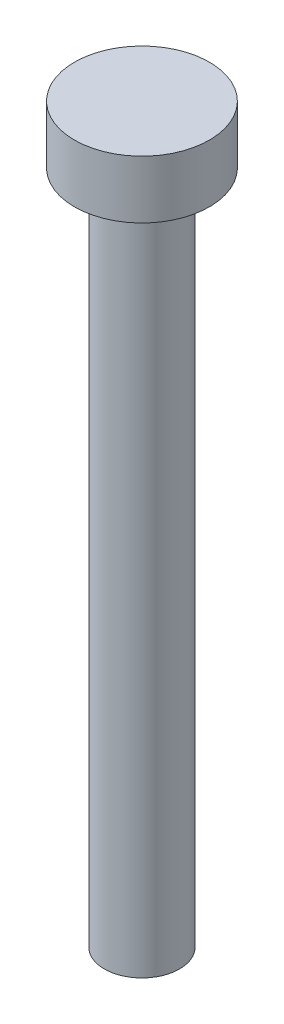
ISO-10303-21;
HEADER;
FILE_DESCRIPTION(('STEP AP214'),'2;1');
FILE_NAME('part.step','',(''),(''),'','','');
FILE_SCHEMA(('AUTOMOTIVE_DESIGN { 1 0 10303 214 1 1 1 1 }'));
ENDSEC;
DATA;
#1=APPLICATION_CONTEXT('core data for automotive mechanical design processes');
#2=APPLICATION_PROTOCOL_DEFINITION('international standard','automotive_design',2000,#1);
#3=PRODUCT_CONTEXT('',#1,'mechanical');
#4=PRODUCT('Part','Part','',(#3));
#5=PRODUCT_RELATED_PRODUCT_CATEGORY('part','',(#4));
#6=PRODUCT_DEFINITION_FORMATION('','',#4);
#7=PRODUCT_DEFINITION_CONTEXT('part definition',#1,'design');
#8=PRODUCT_DEFINITION('design','',#6,#7);
#9=PRODUCT_DEFINITION_SHAPE('','',#8);
#10=(LENGTH_UNIT() NAMED_UNIT(*) SI_UNIT(.MILLI.,.METRE.));
#11=(NAMED_UNIT(*) PLANE_ANGLE_UNIT() SI_UNIT($,.RADIAN.));
#12=(NAMED_UNIT(*) SI_UNIT($,.STERADIAN.) SOLID_ANGLE_UNIT());
#13=UNCERTAINTY_MEASURE_WITH_UNIT(LENGTH_MEASURE(1.E-05),#10,'distance_accuracy_value','');
#14=(GEOMETRIC_REPRESENTATION_CONTEXT(3) GLOBAL_UNCERTAINTY_ASSIGNED_CONTEXT((#13)) GLOBAL_UNIT_ASSIGNED_CONTEXT((#10,
#11,#12)) REPRESENTATION_CONTEXT('',''));
#15=CARTESIAN_POINT('',(0.,0.,0.));
#16=DIRECTION('',(0.,0.,1.));
#17=DIRECTION('',(1.,0.,0.));
#18=AXIS2_PLACEMENT_3D('',#15,#16,#17);
#19=CARTESIAN_POINT('',(0.,3.,0.));
#20=DIRECTION('',(0.,-1.,0.));
#21=DIRECTION('',(0.,0.,-1.));
#22=AXIS2_PLACEMENT_3D('',#19,#20,#21);
#23=CYLINDRICAL_SURFACE('',#22,3.5);
#24=CARTESIAN_POINT('',(0.,3.,0.));
#25=DIRECTION('',(0.,1.,0.));
#26=DIRECTION('',(0.,0.,1.));
#27=AXIS2_PLACEMENT_3D('',#24,#25,#26);
#28=CIRCLE('',#27,3.5);
#29=CARTESIAN_POINT('',(0.,3.,3.5));
#30=VERTEX_POINT('',#29);
#31=EDGE_CURVE('E42',#30,#30,#28,.T.);
#32=ORIENTED_EDGE('',*,*,#31,.F.);
#33=EDGE_LOOP('',(#32));
#34=FACE_BOUND('',#33,.T.);
#35=CARTESIAN_POINT('',(0.,0.,0.));
#36=DIRECTION('',(0.,1.,0.));
#37=DIRECTION('',(0.,0.,1.));
#38=AXIS2_PLACEMENT_3D('',#35,#36,#37);
#39=CIRCLE('',#38,3.5);
#40=CARTESIAN_POINT('',(0.,0.,3.5));
#41=VERTEX_POINT('',#40);
#42=EDGE_CURVE('E38',#41,#41,#39,.T.);
#43=ORIENTED_EDGE('',*,*,#42,.T.);
#44=EDGE_LOOP('',(#43));
#45=FACE_BOUND('',#44,.T.);
#46=ADVANCED_FACE('F35',(#34,#45),#23,.T.);
#47=CARTESIAN_POINT('',(0.,3.,0.));
#48=DIRECTION('',(0.,1.,0.));
#49=DIRECTION('',(0.,0.,1.));
#50=AXIS2_PLACEMENT_3D('',#47,#48,#49);
#51=PLANE('',#50);
#52=ORIENTED_EDGE('',*,*,#31,.T.);
#53=EDGE_LOOP('',(#52));
#54=FACE_BOUND('',#53,.T.);
#55=ADVANCED_FACE('F59',(#54),#51,.T.);
#56=CARTESIAN_POINT('',(0.,0.,0.));
#57=DIRECTION('',(0.,1.,0.));
#58=DIRECTION('',(0.,0.,1.));
#59=AXIS2_PLACEMENT_3D('',#56,#57,#58);
#60=PLANE('',#59);
#61=CARTESIAN_POINT('',(0.,0.,0.));
#62=DIRECTION('',(0.,-1.,0.));
#63=DIRECTION('',(0.,0.,-1.));
#64=AXIS2_PLACEMENT_3D('',#61,#62,#63);
#65=CIRCLE('',#64,1.95);
#66=CARTESIAN_POINT('',(0.,0.,-1.95));
#67=VERTEX_POINT('',#66);
#68=EDGE_CURVE('E10',#67,#67,#65,.T.);
#69=ORIENTED_EDGE('',*,*,#68,.F.);
#70=EDGE_LOOP('',(#69));
#71=FACE_BOUND('',#70,.T.);
#72=ORIENTED_EDGE('',*,*,#42,.F.);
#73=EDGE_LOOP('',(#72));
#74=FACE_BOUND('',#73,.T.);
#75=ADVANCED_FACE('F56',(#71,#74),#60,.F.);
#76=CARTESIAN_POINT('',(0.,-35.,0.));
#77=DIRECTION('',(0.,1.,0.));
#78=DIRECTION('',(0.,0.,1.));
#79=AXIS2_PLACEMENT_3D('',#76,#77,#78);
#80=CYLINDRICAL_SURFACE('',#79,1.95);
#81=CARTESIAN_POINT('',(0.,-35.,0.));
#82=DIRECTION('',(0.,-1.,0.));
#83=DIRECTION('',(0.,0.,-1.));
#84=AXIS2_PLACEMENT_3D('',#81,#82,#83);
#85=CIRCLE('',#84,1.95);
#86=CARTESIAN_POINT('',(0.,-35.,-1.95));
#87=VERTEX_POINT('',#86);
#88=EDGE_CURVE('E48',#87,#87,#85,.T.);
#89=ORIENTED_EDGE('',*,*,#88,.F.);
#90=EDGE_LOOP('',(#89));
#91=FACE_BOUND('',#90,.T.);
#92=ORIENTED_EDGE('',*,*,#68,.T.);
#93=EDGE_LOOP('',(#92));
#94=FACE_BOUND('',#93,.T.);
#95=ADVANCED_FACE('F58',(#91,#94),#80,.T.);
#96=CARTESIAN_POINT('',(0.,-35.,0.));
#97=DIRECTION('',(0.,-1.,0.));
#98=DIRECTION('',(0.,0.,-1.));
#99=AXIS2_PLACEMENT_3D('',#96,#97,#98);
#100=PLANE('',#99);
#101=ORIENTED_EDGE('',*,*,#88,.T.);
#102=EDGE_LOOP('',(#101));
#103=FACE_BOUND('',#102,.T.);
#104=ADVANCED_FACE('F65',(#103),#100,.T.);
#105=CLOSED_SHELL('',(#46,#55,#75,#95,#104));
#106=MANIFOLD_SOLID_BREP('B2',#105);
#107=ADVANCED_BREP_SHAPE_REPRESENTATION('',(#18,#106),#14);
#108=SHAPE_DEFINITION_REPRESENTATION(#9,#107);
ENDSEC;
END-ISO-10303-21;
